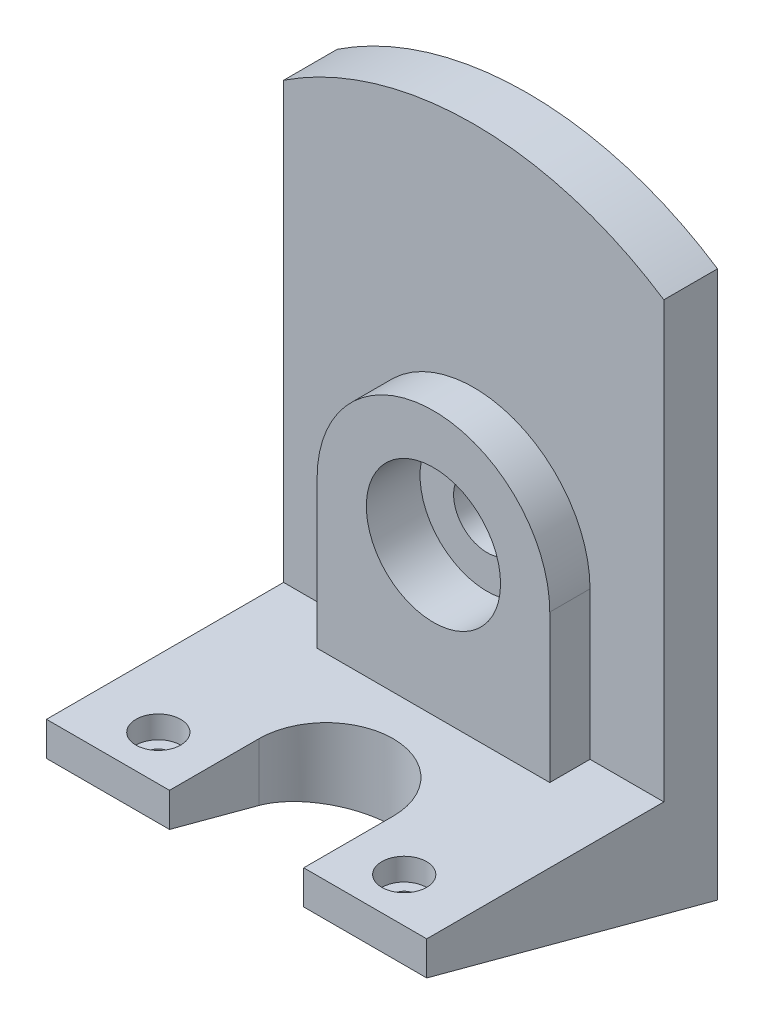
ISO-10303-21;
HEADER;
FILE_DESCRIPTION(('STEP AP214'),'2;1');
FILE_NAME('part.step','',(''),(''),'','','');
FILE_SCHEMA(('AUTOMOTIVE_DESIGN { 1 0 10303 214 1 1 1 1 }'));
ENDSEC;
DATA;
#1=APPLICATION_CONTEXT('core data for automotive mechanical design processes');
#2=APPLICATION_PROTOCOL_DEFINITION('international standard','automotive_design',2000,#1);
#3=PRODUCT_CONTEXT('',#1,'mechanical');
#4=PRODUCT('Part','Part','',(#3));
#5=PRODUCT_RELATED_PRODUCT_CATEGORY('part','',(#4));
#6=PRODUCT_DEFINITION_FORMATION('','',#4);
#7=PRODUCT_DEFINITION_CONTEXT('part definition',#1,'design');
#8=PRODUCT_DEFINITION('design','',#6,#7);
#9=PRODUCT_DEFINITION_SHAPE('','',#8);
#10=(LENGTH_UNIT() NAMED_UNIT(*) SI_UNIT(.MILLI.,.METRE.));
#11=(NAMED_UNIT(*) PLANE_ANGLE_UNIT() SI_UNIT($,.RADIAN.));
#12=(NAMED_UNIT(*) SI_UNIT($,.STERADIAN.) SOLID_ANGLE_UNIT());
#13=UNCERTAINTY_MEASURE_WITH_UNIT(LENGTH_MEASURE(1.E-05),#10,'distance_accuracy_value','');
#14=(GEOMETRIC_REPRESENTATION_CONTEXT(3) GLOBAL_UNCERTAINTY_ASSIGNED_CONTEXT((#13)) GLOBAL_UNIT_ASSIGNED_CONTEXT((#10,
#11,#12)) REPRESENTATION_CONTEXT('',''));
#15=CARTESIAN_POINT('',(0.,0.,0.));
#16=DIRECTION('',(0.,0.,1.));
#17=DIRECTION('',(1.,0.,0.));
#18=AXIS2_PLACEMENT_3D('',#15,#16,#17);
#19=CARTESIAN_POINT('',(42.5,17.416697508023,65.));
#20=DIRECTION('',(0.,0.,-1.));
#21=DIRECTION('',(-1.,0.,0.));
#22=AXIS2_PLACEMENT_3D('',#19,#20,#21);
#23=PLANE('',#22);
#24=DIRECTION('',(-1.,0.,0.));
#25=VECTOR('',#24,1.);
#26=CARTESIAN_POINT('',(42.5,17.416697508023,65.));
#27=LINE('',#26,#25);
#28=CARTESIAN_POINT('',(-15.,17.416697508023,65.));
#29=VERTEX_POINT('',#28);
#30=CARTESIAN_POINT('',(-42.5,17.416697508023,65.));
#31=VERTEX_POINT('',#30);
#32=EDGE_CURVE('E251',#29,#31,#27,.T.);
#33=ORIENTED_EDGE('',*,*,#32,.F.);
#34=DIRECTION('',(0.,1.,0.));
#35=VECTOR('',#34,1.);
#36=CARTESIAN_POINT('',(-15.,0.,65.));
#37=LINE('',#36,#35);
#38=CARTESIAN_POINT('',(-15.,25.,65.));
#39=VERTEX_POINT('',#38);
#40=EDGE_CURVE('E153',#29,#39,#37,.T.);
#41=ORIENTED_EDGE('',*,*,#40,.T.);
#42=DIRECTION('',(-1.,0.,0.));
#43=VECTOR('',#42,1.);
#44=CARTESIAN_POINT('',(42.5,25.,65.));
#45=LINE('',#44,#43);
#46=CARTESIAN_POINT('',(-42.5,25.,65.));
#47=VERTEX_POINT('',#46);
#48=EDGE_CURVE('E255',#39,#47,#45,.T.);
#49=ORIENTED_EDGE('',*,*,#48,.T.);
#50=DIRECTION('',(0.,-1.,0.));
#51=VECTOR('',#50,1.);
#52=CARTESIAN_POINT('',(-42.5,17.416697508023,65.));
#53=LINE('',#52,#51);
#54=EDGE_CURVE('E245',#47,#31,#53,.T.);
#55=ORIENTED_EDGE('',*,*,#54,.T.);
#56=EDGE_LOOP('',(#33,#41,#49,#55));
#57=FACE_BOUND('',#56,.T.);
#58=ADVANCED_FACE('F43',(#57),#23,.F.);
#59=CARTESIAN_POINT('',(42.5,25.,12.));
#60=DIRECTION('',(0.,0.,-1.));
#61=DIRECTION('',(-1.,0.,0.));
#62=AXIS2_PLACEMENT_3D('',#59,#60,#61);
#63=PLANE('',#62);
#64=DIRECTION('',(0.,1.,0.));
#65=VECTOR('',#64,1.);
#66=CARTESIAN_POINT('',(26.,58.,12.));
#67=LINE('',#66,#65);
#68=CARTESIAN_POINT('',(26.,25.,12.));
#69=VERTEX_POINT('',#68);
#70=CARTESIAN_POINT('',(26.,58.,12.));
#71=VERTEX_POINT('',#70);
#72=EDGE_CURVE('E183',#69,#71,#67,.T.);
#73=ORIENTED_EDGE('',*,*,#72,.F.);
#74=DIRECTION('',(-1.,0.,0.));
#75=VECTOR('',#74,1.);
#76=CARTESIAN_POINT('',(42.5,25.,12.));
#77=LINE('',#76,#75);
#78=CARTESIAN_POINT('',(42.5,25.,12.));
#79=VERTEX_POINT('',#78);
#80=EDGE_CURVE('E218',#79,#69,#77,.T.);
#81=ORIENTED_EDGE('',*,*,#80,.F.);
#82=DIRECTION('',(0.,-1.,0.));
#83=VECTOR('',#82,1.);
#84=CARTESIAN_POINT('',(42.5,25.,12.));
#85=LINE('',#84,#83);
#86=CARTESIAN_POINT('',(42.5,122.208644277854,12.));
#87=VERTEX_POINT('',#86);
#88=EDGE_CURVE('E227',#87,#79,#85,.T.);
#89=ORIENTED_EDGE('',*,*,#88,.F.);
#90=CARTESIAN_POINT('',(0.,58.,12.));
#91=DIRECTION('',(0.,0.,-1.));
#92=DIRECTION('',(-1.,0.,0.));
#93=AXIS2_PLACEMENT_3D('',#90,#91,#92);
#94=CIRCLE('',#93,77.);
#95=CARTESIAN_POINT('',(-42.5,122.208644277854,12.));
#96=VERTEX_POINT('',#95);
#97=EDGE_CURVE('E213',#96,#87,#94,.T.);
#98=ORIENTED_EDGE('',*,*,#97,.F.);
#99=DIRECTION('',(0.,-1.,0.));
#100=VECTOR('',#99,1.);
#101=CARTESIAN_POINT('',(-42.5,25.,12.));
#102=LINE('',#101,#100);
#103=CARTESIAN_POINT('',(-42.5,25.,12.));
#104=VERTEX_POINT('',#103);
#105=EDGE_CURVE('E239',#96,#104,#102,.T.);
#106=ORIENTED_EDGE('',*,*,#105,.T.);
#107=CARTESIAN_POINT('',(-26.,25.,12.));
#108=VERTEX_POINT('',#107);
#109=EDGE_CURVE('E258',#108,#104,#77,.T.);
#110=ORIENTED_EDGE('',*,*,#109,.F.);
#111=DIRECTION('',(0.,-1.,0.));
#112=VECTOR('',#111,1.);
#113=CARTESIAN_POINT('',(-26.,25.,12.));
#114=LINE('',#113,#112);
#115=CARTESIAN_POINT('',(-26.,58.,12.));
#116=VERTEX_POINT('',#115);
#117=EDGE_CURVE('E188',#116,#108,#114,.T.);
#118=ORIENTED_EDGE('',*,*,#117,.F.);
#119=CARTESIAN_POINT('',(0.,58.,12.));
#120=DIRECTION('',(0.,0.,1.));
#121=DIRECTION('',(-1.,0.,0.));
#122=AXIS2_PLACEMENT_3D('',#119,#120,#121);
#123=CIRCLE('',#122,26.);
#124=EDGE_CURVE('E68',#71,#116,#123,.T.);
#125=ORIENTED_EDGE('',*,*,#124,.F.);
#126=EDGE_LOOP('',(#73,#81,#89,#98,#106,#110,#118,#125));
#127=FACE_BOUND('',#126,.T.);
#128=ADVANCED_FACE('F294',(#127),#63,.F.);
#129=CARTESIAN_POINT('',(42.5,25.,65.));
#130=DIRECTION('',(0.,-1.,0.));
#131=DIRECTION('',(0.,0.,-1.));
#132=AXIS2_PLACEMENT_3D('',#129,#130,#131);
#133=PLANE('',#132);
#134=CARTESIAN_POINT('',(-27.5,25.,55.));
#135=DIRECTION('',(0.,1.,0.));
#136=DIRECTION('',(0.,0.,1.));
#137=AXIS2_PLACEMENT_3D('',#134,#135,#136);
#138=CIRCLE('',#137,5.);
#139=CARTESIAN_POINT('',(-27.5,25.,60.));
#140=VERTEX_POINT('',#139);
#141=EDGE_CURVE('E509',#140,#140,#138,.T.);
#142=ORIENTED_EDGE('',*,*,#141,.F.);
#143=EDGE_LOOP('',(#142));
#144=FACE_BOUND('',#143,.T.);
#145=CARTESIAN_POINT('',(27.5293930867813,25.,55.0588082238899));
#146=DIRECTION('',(0.,1.,0.));
#147=DIRECTION('',(0.,0.,1.));
#148=AXIS2_PLACEMENT_3D('',#145,#146,#147);
#149=CIRCLE('',#148,5.);
#150=CARTESIAN_POINT('',(27.5293930867813,25.,60.0588082238899));
#151=VERTEX_POINT('',#150);
#152=EDGE_CURVE('E273',#151,#151,#149,.T.);
#153=ORIENTED_EDGE('',*,*,#152,.F.);
#154=EDGE_LOOP('',(#153));
#155=FACE_BOUND('',#154,.T.);
#156=ORIENTED_EDGE('',*,*,#48,.F.);
#157=DIRECTION('',(0.,0.,-1.));
#158=VECTOR('',#157,1.);
#159=CARTESIAN_POINT('',(-15.,25.,65.));
#160=LINE('',#159,#158);
#161=CARTESIAN_POINT('',(-15.,25.,45.));
#162=VERTEX_POINT('',#161);
#163=EDGE_CURVE('E166',#39,#162,#160,.T.);
#164=ORIENTED_EDGE('',*,*,#163,.T.);
#165=CARTESIAN_POINT('',(0.,25.,45.));
#166=DIRECTION('',(0.,-1.,0.));
#167=DIRECTION('',(0.,0.,-1.));
#168=AXIS2_PLACEMENT_3D('',#165,#166,#167);
#169=CIRCLE('',#168,15.);
#170=CARTESIAN_POINT('',(15.,25.,45.));
#171=VERTEX_POINT('',#170);
#172=EDGE_CURVE('E152',#162,#171,#169,.T.);
#173=ORIENTED_EDGE('',*,*,#172,.T.);
#174=DIRECTION('',(0.,0.,1.));
#175=VECTOR('',#174,1.);
#176=CARTESIAN_POINT('',(15.,25.,65.));
#177=LINE('',#176,#175);
#178=CARTESIAN_POINT('',(15.,25.,65.));
#179=VERTEX_POINT('',#178);
#180=EDGE_CURVE('E144',#171,#179,#177,.T.);
#181=ORIENTED_EDGE('',*,*,#180,.T.);
#182=CARTESIAN_POINT('',(42.5,25.,65.));
#183=VERTEX_POINT('',#182);
#184=EDGE_CURVE('E256',#183,#179,#45,.T.);
#185=ORIENTED_EDGE('',*,*,#184,.F.);
#186=DIRECTION('',(0.,0.,1.));
#187=VECTOR('',#186,1.);
#188=CARTESIAN_POINT('',(42.5,25.,65.));
#189=LINE('',#188,#187);
#190=EDGE_CURVE('E230',#79,#183,#189,.T.);
#191=ORIENTED_EDGE('',*,*,#190,.F.);
#192=ORIENTED_EDGE('',*,*,#80,.T.);
#193=DIRECTION('',(0.,0.,-1.));
#194=VECTOR('',#193,1.);
#195=CARTESIAN_POINT('',(26.,25.,21.));
#196=LINE('',#195,#194);
#197=CARTESIAN_POINT('',(26.,25.,21.));
#198=VERTEX_POINT('',#197);
#199=EDGE_CURVE('E207',#198,#69,#196,.T.);
#200=ORIENTED_EDGE('',*,*,#199,.F.);
#201=DIRECTION('',(1.,0.,0.));
#202=VECTOR('',#201,1.);
#203=CARTESIAN_POINT('',(26.,25.,21.));
#204=LINE('',#203,#202);
#205=CARTESIAN_POINT('',(-26.,25.,21.));
#206=VERTEX_POINT('',#205);
#207=EDGE_CURVE('E184',#206,#198,#204,.T.);
#208=ORIENTED_EDGE('',*,*,#207,.F.);
#209=DIRECTION('',(0.,0.,-1.));
#210=VECTOR('',#209,1.);
#211=CARTESIAN_POINT('',(-26.,25.,21.));
#212=LINE('',#211,#210);
#213=EDGE_CURVE('E195',#206,#108,#212,.T.);
#214=ORIENTED_EDGE('',*,*,#213,.T.);
#215=ORIENTED_EDGE('',*,*,#109,.T.);
#216=DIRECTION('',(0.,0.,1.));
#217=VECTOR('',#216,1.);
#218=CARTESIAN_POINT('',(-42.5,25.,65.));
#219=LINE('',#218,#217);
#220=EDGE_CURVE('E242',#104,#47,#219,.T.);
#221=ORIENTED_EDGE('',*,*,#220,.T.);
#222=EDGE_LOOP('',(#156,#164,#173,#181,#185,#191,#192,#200,#208,#214,#215,#221));
#223=FACE_BOUND('',#222,.T.);
#224=ADVANCED_FACE('F165',(#144,#155,#223),#133,.F.);
#225=CARTESIAN_POINT('',(42.5,135.,0.));
#226=DIRECTION('',(0.,0.,1.));
#227=DIRECTION('',(1.,0.,0.));
#228=AXIS2_PLACEMENT_3D('',#225,#226,#227);
#229=PLANE('',#228);
#230=CARTESIAN_POINT('',(0.,58.,0.));
#231=DIRECTION('',(0.,0.,1.));
#232=DIRECTION('',(1.,0.,0.));
#233=AXIS2_PLACEMENT_3D('',#230,#231,#232);
#234=CIRCLE('',#233,7.5);
#235=CARTESIAN_POINT('',(7.5,58.,0.));
#236=VERTEX_POINT('',#235);
#237=EDGE_CURVE('E180',#236,#236,#234,.T.);
#238=ORIENTED_EDGE('',*,*,#237,.T.);
#239=EDGE_LOOP('',(#238));
#240=FACE_BOUND('',#239,.T.);
#241=CARTESIAN_POINT('',(0.,58.,0.));
#242=DIRECTION('',(0.,0.,1.));
#243=DIRECTION('',(1.,0.,0.));
#244=AXIS2_PLACEMENT_3D('',#241,#242,#243);
#245=CIRCLE('',#244,77.);
#246=CARTESIAN_POINT('',(42.5,122.208644277854,0.));
#247=VERTEX_POINT('',#246);
#248=CARTESIAN_POINT('',(-42.5,122.208644277854,0.));
#249=VERTEX_POINT('',#248);
#250=EDGE_CURVE('E221',#247,#249,#245,.T.);
#251=ORIENTED_EDGE('',*,*,#250,.F.);
#252=DIRECTION('',(0.,1.,0.));
#253=VECTOR('',#252,1.);
#254=CARTESIAN_POINT('',(42.5,135.,0.));
#255=LINE('',#254,#253);
#256=CARTESIAN_POINT('',(42.5,0.,0.));
#257=VERTEX_POINT('',#256);
#258=EDGE_CURVE('E224',#257,#247,#255,.T.);
#259=ORIENTED_EDGE('',*,*,#258,.F.);
#260=DIRECTION('',(-1.,0.,0.));
#261=VECTOR('',#260,1.);
#262=CARTESIAN_POINT('',(42.5,0.,0.));
#263=LINE('',#262,#261);
#264=CARTESIAN_POINT('',(-42.5,0.,0.));
#265=VERTEX_POINT('',#264);
#266=EDGE_CURVE('E236',#257,#265,#263,.T.);
#267=ORIENTED_EDGE('',*,*,#266,.T.);
#268=DIRECTION('',(0.,1.,0.));
#269=VECTOR('',#268,1.);
#270=CARTESIAN_POINT('',(-42.5,135.,0.));
#271=LINE('',#270,#269);
#272=EDGE_CURVE('E223',#265,#249,#271,.T.);
#273=ORIENTED_EDGE('',*,*,#272,.T.);
#274=EDGE_LOOP('',(#251,#259,#267,#273));
#275=FACE_BOUND('',#274,.T.);
#276=ADVANCED_FACE('F45',(#240,#275),#229,.F.);
#277=ORIENTED_EDGE('',*,*,#184,.T.);
#278=DIRECTION('',(0.,1.,0.));
#279=VECTOR('',#278,1.);
#280=CARTESIAN_POINT('',(15.,0.,65.));
#281=LINE('',#280,#279);
#282=CARTESIAN_POINT('',(15.,17.416697508023,65.));
#283=VERTEX_POINT('',#282);
#284=EDGE_CURVE('E147',#283,#179,#281,.T.);
#285=ORIENTED_EDGE('',*,*,#284,.F.);
#286=CARTESIAN_POINT('',(42.5,17.416697508023,65.));
#287=VERTEX_POINT('',#286);
#288=EDGE_CURVE('E252',#287,#283,#27,.T.);
#289=ORIENTED_EDGE('',*,*,#288,.F.);
#290=DIRECTION('',(0.,-1.,0.));
#291=VECTOR('',#290,1.);
#292=CARTESIAN_POINT('',(42.5,17.416697508023,65.));
#293=LINE('',#292,#291);
#294=EDGE_CURVE('E232',#183,#287,#293,.T.);
#295=ORIENTED_EDGE('',*,*,#294,.F.);
#296=EDGE_LOOP('',(#277,#285,#289,#295));
#297=FACE_BOUND('',#296,.T.);
#298=ADVANCED_FACE('F287',(#297),#23,.F.);
#299=CARTESIAN_POINT('',(42.5,0.,0.));
#300=DIRECTION('',(0.,0.965925826289068,-0.258819045102521));
#301=DIRECTION('',(0.,0.258819045102521,0.965925826289068));
#302=AXIS2_PLACEMENT_3D('',#299,#300,#301);
#303=PLANE('',#302);
#304=CARTESIAN_POINT('',(-27.5,14.7372055837118,55.));
#305=DIRECTION('',(0.,0.965925826289068,-0.258819045102521));
#306=DIRECTION('',(0.,0.258819045102521,0.965925826289068));
#307=AXIS2_PLACEMENT_3D('',#304,#305,#306);
#308=ELLIPSE('',#307,2.58819045102521,2.5);
#309=CARTESIAN_POINT('',(-27.5,15.4070785647896,57.5));
#310=VERTEX_POINT('',#309);
#311=EDGE_CURVE('E47',#310,#310,#308,.T.);
#312=ORIENTED_EDGE('',*,*,#311,.T.);
#313=EDGE_LOOP('',(#312));
#314=FACE_BOUND('',#313,.T.);
#315=CARTESIAN_POINT('',(27.5293930867813,14.7529631998114,55.0588082238899));
#316=DIRECTION('',(0.,0.965925826289068,-0.258819045102521));
#317=DIRECTION('',(0.,0.258819045102521,0.965925826289068));
#318=AXIS2_PLACEMENT_3D('',#315,#316,#317);
#319=ELLIPSE('',#318,2.58819045102521,2.5);
#320=CARTESIAN_POINT('',(27.5293930867813,15.4228361808892,57.5588082238899));
#321=VERTEX_POINT('',#320);
#322=EDGE_CURVE('E262',#321,#321,#319,.T.);
#323=ORIENTED_EDGE('',*,*,#322,.T.);
#324=EDGE_LOOP('',(#323));
#325=FACE_BOUND('',#324,.T.);
#326=CARTESIAN_POINT('',(0.,12.0577136594005,45.));
#327=DIRECTION('',(0.,0.965925826289068,-0.258819045102521));
#328=DIRECTION('',(0.,0.258819045102521,0.965925826289068));
#329=AXIS2_PLACEMENT_3D('',#326,#327,#328);
#330=ELLIPSE('',#329,15.5291427061512,15.);
#331=CARTESIAN_POINT('',(15.,12.0577136594005,45.));
#332=VERTEX_POINT('',#331);
#333=CARTESIAN_POINT('',(-15.,12.0577136594005,45.));
#334=VERTEX_POINT('',#333);
#335=EDGE_CURVE('E52',#332,#334,#330,.T.);
#336=ORIENTED_EDGE('',*,*,#335,.T.);
#337=DIRECTION('',(0.,0.258819045102521,0.965925826289068));
#338=VECTOR('',#337,1.);
#339=CARTESIAN_POINT('',(-15.,0.,0.));
#340=LINE('',#339,#338);
#341=EDGE_CURVE('E11',#334,#29,#340,.T.);
#342=ORIENTED_EDGE('',*,*,#341,.T.);
#343=ORIENTED_EDGE('',*,*,#32,.T.);
#344=DIRECTION('',(0.,-0.258819045102521,-0.965925826289068));
#345=VECTOR('',#344,1.);
#346=CARTESIAN_POINT('',(-42.5,0.,0.));
#347=LINE('',#346,#345);
#348=EDGE_CURVE('E228',#31,#265,#347,.T.);
#349=ORIENTED_EDGE('',*,*,#348,.T.);
#350=ORIENTED_EDGE('',*,*,#266,.F.);
#351=DIRECTION('',(0.,-0.258819045102521,-0.965925826289068));
#352=VECTOR('',#351,1.);
#353=CARTESIAN_POINT('',(42.5,0.,0.));
#354=LINE('',#353,#352);
#355=EDGE_CURVE('E234',#287,#257,#354,.T.);
#356=ORIENTED_EDGE('',*,*,#355,.F.);
#357=ORIENTED_EDGE('',*,*,#288,.T.);
#358=DIRECTION('',(0.,-0.258819045102521,-0.965925826289068));
#359=VECTOR('',#358,1.);
#360=CARTESIAN_POINT('',(15.,0.,0.));
#361=LINE('',#360,#359);
#362=EDGE_CURVE('E217',#283,#332,#361,.T.);
#363=ORIENTED_EDGE('',*,*,#362,.T.);
#364=EDGE_LOOP('',(#336,#342,#343,#349,#350,#356,#357,#363));
#365=FACE_BOUND('',#364,.T.);
#366=ADVANCED_FACE('F282',(#314,#325,#365),#303,.F.);
#367=CARTESIAN_POINT('',(42.5,0.,0.));
#368=DIRECTION('',(1.,0.,0.));
#369=DIRECTION('',(0.,0.,-1.));
#370=AXIS2_PLACEMENT_3D('',#367,#368,#369);
#371=PLANE('',#370);
#372=DIRECTION('',(0.,0.,-1.));
#373=VECTOR('',#372,1.);
#374=CARTESIAN_POINT('',(42.5,122.208644277854,242.330414711903));
#375=LINE('',#374,#373);
#376=EDGE_CURVE('E210',#87,#247,#375,.T.);
#377=ORIENTED_EDGE('',*,*,#376,.F.);
#378=ORIENTED_EDGE('',*,*,#88,.T.);
#379=ORIENTED_EDGE('',*,*,#190,.T.);
#380=ORIENTED_EDGE('',*,*,#294,.T.);
#381=ORIENTED_EDGE('',*,*,#355,.T.);
#382=ORIENTED_EDGE('',*,*,#258,.T.);
#383=EDGE_LOOP('',(#377,#378,#379,#380,#381,#382));
#384=FACE_BOUND('',#383,.T.);
#385=ADVANCED_FACE('F293',(#384),#371,.T.);
#386=CARTESIAN_POINT('',(-42.5,0.,0.));
#387=DIRECTION('',(1.,0.,0.));
#388=DIRECTION('',(0.,0.,-1.));
#389=AXIS2_PLACEMENT_3D('',#386,#387,#388);
#390=PLANE('',#389);
#391=ORIENTED_EDGE('',*,*,#105,.F.);
#392=DIRECTION('',(0.,0.,-1.));
#393=VECTOR('',#392,1.);
#394=CARTESIAN_POINT('',(-42.5,122.208644277854,242.330414711903));
#395=LINE('',#394,#393);
#396=EDGE_CURVE('E214',#96,#249,#395,.T.);
#397=ORIENTED_EDGE('',*,*,#396,.T.);
#398=ORIENTED_EDGE('',*,*,#272,.F.);
#399=ORIENTED_EDGE('',*,*,#348,.F.);
#400=ORIENTED_EDGE('',*,*,#54,.F.);
#401=ORIENTED_EDGE('',*,*,#220,.F.);
#402=EDGE_LOOP('',(#391,#397,#398,#399,#400,#401));
#403=FACE_BOUND('',#402,.T.);
#404=ADVANCED_FACE('F352',(#403),#390,.F.);
#405=CARTESIAN_POINT('',(0.,58.,242.330414711903));
#406=DIRECTION('',(0.,0.,-1.));
#407=DIRECTION('',(-1.,0.,0.));
#408=AXIS2_PLACEMENT_3D('',#405,#406,#407);
#409=CYLINDRICAL_SURFACE('',#408,77.);
#410=ORIENTED_EDGE('',*,*,#376,.T.);
#411=ORIENTED_EDGE('',*,*,#250,.T.);
#412=ORIENTED_EDGE('',*,*,#396,.F.);
#413=ORIENTED_EDGE('',*,*,#97,.T.);
#414=EDGE_LOOP('',(#410,#411,#412,#413));
#415=FACE_BOUND('',#414,.T.);
#416=ADVANCED_FACE('F350',(#415),#409,.T.);
#417=CARTESIAN_POINT('',(26.,58.,21.));
#418=DIRECTION('',(-1.,0.,0.));
#419=DIRECTION('',(0.,0.,1.));
#420=AXIS2_PLACEMENT_3D('',#417,#418,#419);
#421=PLANE('',#420);
#422=ORIENTED_EDGE('',*,*,#72,.T.);
#423=DIRECTION('',(0.,0.,-1.));
#424=VECTOR('',#423,1.);
#425=CARTESIAN_POINT('',(26.,58.,21.));
#426=LINE('',#425,#424);
#427=CARTESIAN_POINT('',(26.,58.,21.));
#428=VERTEX_POINT('',#427);
#429=EDGE_CURVE('E204',#428,#71,#426,.T.);
#430=ORIENTED_EDGE('',*,*,#429,.F.);
#431=DIRECTION('',(0.,1.,0.));
#432=VECTOR('',#431,1.);
#433=CARTESIAN_POINT('',(26.,58.,21.));
#434=LINE('',#433,#432);
#435=EDGE_CURVE('E187',#198,#428,#434,.T.);
#436=ORIENTED_EDGE('',*,*,#435,.F.);
#437=ORIENTED_EDGE('',*,*,#199,.T.);
#438=EDGE_LOOP('',(#422,#430,#436,#437));
#439=FACE_BOUND('',#438,.T.);
#440=ADVANCED_FACE('F297',(#439),#421,.F.);
#441=CARTESIAN_POINT('',(0.,58.,21.));
#442=DIRECTION('',(0.,0.,-1.));
#443=DIRECTION('',(-1.,0.,0.));
#444=AXIS2_PLACEMENT_3D('',#441,#442,#443);
#445=CYLINDRICAL_SURFACE('',#444,26.);
#446=ORIENTED_EDGE('',*,*,#124,.T.);
#447=DIRECTION('',(0.,0.,-1.));
#448=VECTOR('',#447,1.);
#449=CARTESIAN_POINT('',(-26.,58.,21.));
#450=LINE('',#449,#448);
#451=CARTESIAN_POINT('',(-26.,58.,21.));
#452=VERTEX_POINT('',#451);
#453=EDGE_CURVE('E201',#452,#116,#450,.T.);
#454=ORIENTED_EDGE('',*,*,#453,.F.);
#455=CARTESIAN_POINT('',(0.,58.,21.));
#456=DIRECTION('',(0.,0.,1.));
#457=DIRECTION('',(-1.,0.,0.));
#458=AXIS2_PLACEMENT_3D('',#455,#456,#457);
#459=CIRCLE('',#458,26.);
#460=EDGE_CURVE('E190',#428,#452,#459,.T.);
#461=ORIENTED_EDGE('',*,*,#460,.F.);
#462=ORIENTED_EDGE('',*,*,#429,.T.);
#463=EDGE_LOOP('',(#446,#454,#461,#462));
#464=FACE_BOUND('',#463,.T.);
#465=ADVANCED_FACE('F301',(#464),#445,.T.);
#466=CARTESIAN_POINT('',(-26.,25.,21.));
#467=DIRECTION('',(1.,0.,0.));
#468=DIRECTION('',(0.,1.,0.));
#469=AXIS2_PLACEMENT_3D('',#466,#467,#468);
#470=PLANE('',#469);
#471=ORIENTED_EDGE('',*,*,#117,.T.);
#472=ORIENTED_EDGE('',*,*,#213,.F.);
#473=DIRECTION('',(0.,-1.,0.));
#474=VECTOR('',#473,1.);
#475=CARTESIAN_POINT('',(-26.,25.,21.));
#476=LINE('',#475,#474);
#477=EDGE_CURVE('E192',#452,#206,#476,.T.);
#478=ORIENTED_EDGE('',*,*,#477,.F.);
#479=ORIENTED_EDGE('',*,*,#453,.T.);
#480=EDGE_LOOP('',(#471,#472,#478,#479));
#481=FACE_BOUND('',#480,.T.);
#482=ADVANCED_FACE('F311',(#481),#470,.F.);
#483=CARTESIAN_POINT('',(0.,58.,21.));
#484=DIRECTION('',(0.,0.,-1.));
#485=DIRECTION('',(-1.,0.,0.));
#486=AXIS2_PLACEMENT_3D('',#483,#484,#485);
#487=PLANE('',#486);
#488=CARTESIAN_POINT('',(0.,58.,21.));
#489=DIRECTION('',(0.,0.,1.));
#490=DIRECTION('',(1.,0.,0.));
#491=AXIS2_PLACEMENT_3D('',#488,#489,#490);
#492=CIRCLE('',#491,15.);
#493=CARTESIAN_POINT('',(15.,58.,21.));
#494=VERTEX_POINT('',#493);
#495=EDGE_CURVE('E168',#494,#494,#492,.T.);
#496=ORIENTED_EDGE('',*,*,#495,.F.);
#497=EDGE_LOOP('',(#496));
#498=FACE_BOUND('',#497,.T.);
#499=ORIENTED_EDGE('',*,*,#207,.T.);
#500=ORIENTED_EDGE('',*,*,#435,.T.);
#501=ORIENTED_EDGE('',*,*,#460,.T.);
#502=ORIENTED_EDGE('',*,*,#477,.T.);
#503=EDGE_LOOP('',(#499,#500,#501,#502));
#504=FACE_BOUND('',#503,.T.);
#505=ADVANCED_FACE('F305',(#498,#504),#487,.F.);
#506=CARTESIAN_POINT('',(0.,58.,21.));
#507=DIRECTION('',(0.,0.,1.));
#508=DIRECTION('',(1.,0.,0.));
#509=AXIS2_PLACEMENT_3D('',#506,#507,#508);
#510=CYLINDRICAL_SURFACE('',#509,7.5);
#511=ORIENTED_EDGE('',*,*,#237,.F.);
#512=EDGE_LOOP('',(#511));
#513=FACE_BOUND('',#512,.T.);
#514=CARTESIAN_POINT('',(0.,58.,9.));
#515=DIRECTION('',(0.,0.,1.));
#516=DIRECTION('',(1.,0.,0.));
#517=AXIS2_PLACEMENT_3D('',#514,#515,#516);
#518=CIRCLE('',#517,7.5);
#519=CARTESIAN_POINT('',(7.5,58.,9.));
#520=VERTEX_POINT('',#519);
#521=EDGE_CURVE('E177',#520,#520,#518,.T.);
#522=ORIENTED_EDGE('',*,*,#521,.T.);
#523=EDGE_LOOP('',(#522));
#524=FACE_BOUND('',#523,.T.);
#525=ADVANCED_FACE('F319',(#513,#524),#510,.F.);
#526=CARTESIAN_POINT('',(7.5,58.,9.));
#527=DIRECTION('',(0.,0.,-1.));
#528=DIRECTION('',(-1.,0.,0.));
#529=AXIS2_PLACEMENT_3D('',#526,#527,#528);
#530=PLANE('',#529);
#531=ORIENTED_EDGE('',*,*,#521,.F.);
#532=EDGE_LOOP('',(#531));
#533=FACE_BOUND('',#532,.T.);
#534=CARTESIAN_POINT('',(0.,58.,9.));
#535=DIRECTION('',(0.,0.,1.));
#536=DIRECTION('',(1.,0.,0.));
#537=AXIS2_PLACEMENT_3D('',#534,#535,#536);
#538=CIRCLE('',#537,15.);
#539=CARTESIAN_POINT('',(15.,58.,9.));
#540=VERTEX_POINT('',#539);
#541=EDGE_CURVE('E174',#540,#540,#538,.T.);
#542=ORIENTED_EDGE('',*,*,#541,.T.);
#543=EDGE_LOOP('',(#542));
#544=FACE_BOUND('',#543,.T.);
#545=ADVANCED_FACE('F395',(#533,#544),#530,.F.);
#546=CARTESIAN_POINT('',(0.,58.,21.));
#547=DIRECTION('',(0.,0.,1.));
#548=DIRECTION('',(1.,0.,0.));
#549=AXIS2_PLACEMENT_3D('',#546,#547,#548);
#550=CYLINDRICAL_SURFACE('',#549,15.);
#551=ORIENTED_EDGE('',*,*,#541,.F.);
#552=EDGE_LOOP('',(#551));
#553=FACE_BOUND('',#552,.T.);
#554=ORIENTED_EDGE('',*,*,#495,.T.);
#555=EDGE_LOOP('',(#554));
#556=FACE_BOUND('',#555,.T.);
#557=ADVANCED_FACE('F405',(#553,#556),#550,.F.);
#558=CARTESIAN_POINT('',(-15.,0.,45.));
#559=DIRECTION('',(-1.,0.,0.));
#560=DIRECTION('',(0.,0.,1.));
#561=AXIS2_PLACEMENT_3D('',#558,#559,#560);
#562=PLANE('',#561);
#563=ORIENTED_EDGE('',*,*,#40,.F.);
#564=ORIENTED_EDGE('',*,*,#341,.F.);
#565=DIRECTION('',(0.,1.,0.));
#566=VECTOR('',#565,1.);
#567=CARTESIAN_POINT('',(-15.,0.,45.));
#568=LINE('',#567,#566);
#569=EDGE_CURVE('E161',#334,#162,#568,.T.);
#570=ORIENTED_EDGE('',*,*,#569,.T.);
#571=ORIENTED_EDGE('',*,*,#163,.F.);
#572=EDGE_LOOP('',(#563,#564,#570,#571));
#573=FACE_BOUND('',#572,.T.);
#574=ADVANCED_FACE('F280',(#573),#562,.F.);
#575=CARTESIAN_POINT('',(0.,0.,45.));
#576=DIRECTION('',(0.,1.,0.));
#577=DIRECTION('',(0.,0.,1.));
#578=AXIS2_PLACEMENT_3D('',#575,#576,#577);
#579=CYLINDRICAL_SURFACE('',#578,15.);
#580=ORIENTED_EDGE('',*,*,#569,.F.);
#581=ORIENTED_EDGE('',*,*,#335,.F.);
#582=DIRECTION('',(0.,1.,0.));
#583=VECTOR('',#582,1.);
#584=CARTESIAN_POINT('',(15.,0.,45.));
#585=LINE('',#584,#583);
#586=EDGE_CURVE('E60',#332,#171,#585,.T.);
#587=ORIENTED_EDGE('',*,*,#586,.T.);
#588=ORIENTED_EDGE('',*,*,#172,.F.);
#589=EDGE_LOOP('',(#580,#581,#587,#588));
#590=FACE_BOUND('',#589,.T.);
#591=ADVANCED_FACE('F157',(#590),#579,.F.);
#592=CARTESIAN_POINT('',(15.,0.,65.));
#593=DIRECTION('',(1.,0.,0.));
#594=DIRECTION('',(0.,0.,-1.));
#595=AXIS2_PLACEMENT_3D('',#592,#593,#594);
#596=PLANE('',#595);
#597=ORIENTED_EDGE('',*,*,#586,.F.);
#598=ORIENTED_EDGE('',*,*,#362,.F.);
#599=ORIENTED_EDGE('',*,*,#284,.T.);
#600=ORIENTED_EDGE('',*,*,#180,.F.);
#601=EDGE_LOOP('',(#597,#598,#599,#600));
#602=FACE_BOUND('',#601,.T.);
#603=ADVANCED_FACE('F145',(#602),#596,.F.);
#604=CARTESIAN_POINT('',(27.5293930867813,25.,55.0588082238899));
#605=DIRECTION('',(0.,1.,0.));
#606=DIRECTION('',(0.,0.,1.));
#607=AXIS2_PLACEMENT_3D('',#604,#605,#606);
#608=CYLINDRICAL_SURFACE('',#607,2.5);
#609=CARTESIAN_POINT('',(27.5293930867813,20.,55.0588082238899));
#610=DIRECTION('',(0.,1.,0.));
#611=DIRECTION('',(0.,0.,1.));
#612=AXIS2_PLACEMENT_3D('',#609,#610,#611);
#613=CIRCLE('',#612,2.5);
#614=CARTESIAN_POINT('',(27.5293930867813,20.,57.5588082238899));
#615=VERTEX_POINT('',#614);
#616=EDGE_CURVE('E264',#615,#615,#613,.T.);
#617=ORIENTED_EDGE('',*,*,#616,.T.);
#618=EDGE_LOOP('',(#617));
#619=FACE_BOUND('',#618,.T.);
#620=ORIENTED_EDGE('',*,*,#322,.F.);
#621=EDGE_LOOP('',(#620));
#622=FACE_BOUND('',#621,.T.);
#623=ADVANCED_FACE('F442',(#619,#622),#608,.F.);
#624=CARTESIAN_POINT('',(30.0293930867813,20.,55.0588082238899));
#625=DIRECTION('',(0.,-1.,0.));
#626=DIRECTION('',(0.,0.,-1.));
#627=AXIS2_PLACEMENT_3D('',#624,#625,#626);
#628=PLANE('',#627);
#629=ORIENTED_EDGE('',*,*,#616,.F.);
#630=EDGE_LOOP('',(#629));
#631=FACE_BOUND('',#630,.T.);
#632=CARTESIAN_POINT('',(27.5293930867813,20.,55.0588082238899));
#633=DIRECTION('',(0.,1.,0.));
#634=DIRECTION('',(0.,0.,1.));
#635=AXIS2_PLACEMENT_3D('',#632,#633,#634);
#636=CIRCLE('',#635,5.);
#637=CARTESIAN_POINT('',(27.5293930867813,20.,60.0588082238899));
#638=VERTEX_POINT('',#637);
#639=EDGE_CURVE('E268',#638,#638,#636,.T.);
#640=ORIENTED_EDGE('',*,*,#639,.T.);
#641=EDGE_LOOP('',(#640));
#642=FACE_BOUND('',#641,.T.);
#643=ADVANCED_FACE('F451',(#631,#642),#628,.F.);
#644=CARTESIAN_POINT('',(27.5293930867813,25.,55.0588082238899));
#645=DIRECTION('',(0.,1.,0.));
#646=DIRECTION('',(0.,0.,1.));
#647=AXIS2_PLACEMENT_3D('',#644,#645,#646);
#648=CYLINDRICAL_SURFACE('',#647,5.);
#649=ORIENTED_EDGE('',*,*,#639,.F.);
#650=EDGE_LOOP('',(#649));
#651=FACE_BOUND('',#650,.T.);
#652=ORIENTED_EDGE('',*,*,#152,.T.);
#653=EDGE_LOOP('',(#652));
#654=FACE_BOUND('',#653,.T.);
#655=ADVANCED_FACE('F460',(#651,#654),#648,.F.);
#656=CARTESIAN_POINT('',(-27.5,25.,55.));
#657=DIRECTION('',(0.,1.,0.));
#658=DIRECTION('',(0.,0.,1.));
#659=AXIS2_PLACEMENT_3D('',#656,#657,#658);
#660=CYLINDRICAL_SURFACE('',#659,2.5);
#661=CARTESIAN_POINT('',(-27.5,20.,55.));
#662=DIRECTION('',(0.,1.,0.));
#663=DIRECTION('',(0.,0.,1.));
#664=AXIS2_PLACEMENT_3D('',#661,#662,#663);
#665=CIRCLE('',#664,2.5);
#666=CARTESIAN_POINT('',(-27.5,20.,57.5));
#667=VERTEX_POINT('',#666);
#668=EDGE_CURVE('E511',#667,#667,#665,.T.);
#669=ORIENTED_EDGE('',*,*,#668,.T.);
#670=EDGE_LOOP('',(#669));
#671=FACE_BOUND('',#670,.T.);
#672=ORIENTED_EDGE('',*,*,#311,.F.);
#673=EDGE_LOOP('',(#672));
#674=FACE_BOUND('',#673,.T.);
#675=ADVANCED_FACE('F470',(#671,#674),#660,.F.);
#676=CARTESIAN_POINT('',(-25.,20.,55.));
#677=DIRECTION('',(0.,-1.,0.));
#678=DIRECTION('',(0.,0.,-1.));
#679=AXIS2_PLACEMENT_3D('',#676,#677,#678);
#680=PLANE('',#679);
#681=ORIENTED_EDGE('',*,*,#668,.F.);
#682=EDGE_LOOP('',(#681));
#683=FACE_BOUND('',#682,.T.);
#684=CARTESIAN_POINT('',(-27.5,20.,55.));
#685=DIRECTION('',(0.,1.,0.));
#686=DIRECTION('',(0.,0.,1.));
#687=AXIS2_PLACEMENT_3D('',#684,#685,#686);
#688=CIRCLE('',#687,5.);
#689=CARTESIAN_POINT('',(-27.5,20.,60.));
#690=VERTEX_POINT('',#689);
#691=EDGE_CURVE('E506',#690,#690,#688,.T.);
#692=ORIENTED_EDGE('',*,*,#691,.T.);
#693=EDGE_LOOP('',(#692));
#694=FACE_BOUND('',#693,.T.);
#695=ADVANCED_FACE('F480',(#683,#694),#680,.F.);
#696=CARTESIAN_POINT('',(-27.5,25.,55.));
#697=DIRECTION('',(0.,1.,0.));
#698=DIRECTION('',(0.,0.,1.));
#699=AXIS2_PLACEMENT_3D('',#696,#697,#698);
#700=CYLINDRICAL_SURFACE('',#699,5.);
#701=ORIENTED_EDGE('',*,*,#691,.F.);
#702=EDGE_LOOP('',(#701));
#703=FACE_BOUND('',#702,.T.);
#704=ORIENTED_EDGE('',*,*,#141,.T.);
#705=EDGE_LOOP('',(#704));
#706=FACE_BOUND('',#705,.T.);
#707=ADVANCED_FACE('F490',(#703,#706),#700,.F.);
#708=CLOSED_SHELL('',(#58,#128,#224,#276,#298,#366,#385,#404,#416,#440,#465,#482,#505,#525,#545,
#557,#574,#591,#603,#623,#643,#655,#675,#695,#707));
#709=MANIFOLD_SOLID_BREP('B2',#708);
#710=ADVANCED_BREP_SHAPE_REPRESENTATION('',(#18,#709),#14);
#711=SHAPE_DEFINITION_REPRESENTATION(#9,#710);
ENDSEC;
END-ISO-10303-21;
